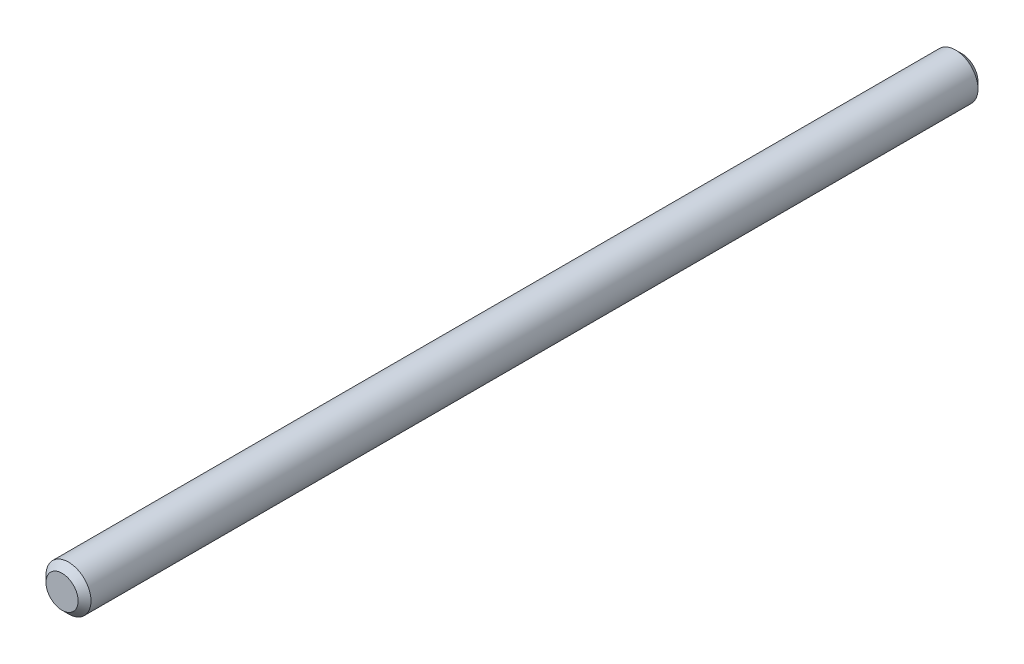
ISO-10303-21;
HEADER;
FILE_DESCRIPTION(('STEP AP214'),'2;1');
FILE_NAME('part.step','',(''),(''),'','','');
FILE_SCHEMA(('AUTOMOTIVE_DESIGN { 1 0 10303 214 1 1 1 1 }'));
ENDSEC;
DATA;
#1=APPLICATION_CONTEXT('core data for automotive mechanical design processes');
#2=APPLICATION_PROTOCOL_DEFINITION('international standard','automotive_design',2000,#1);
#3=PRODUCT_CONTEXT('',#1,'mechanical');
#4=PRODUCT('Part','Part','',(#3));
#5=PRODUCT_RELATED_PRODUCT_CATEGORY('part','',(#4));
#6=PRODUCT_DEFINITION_FORMATION('','',#4);
#7=PRODUCT_DEFINITION_CONTEXT('part definition',#1,'design');
#8=PRODUCT_DEFINITION('design','',#6,#7);
#9=PRODUCT_DEFINITION_SHAPE('','',#8);
#10=(LENGTH_UNIT() NAMED_UNIT(*) SI_UNIT(.MILLI.,.METRE.));
#11=(NAMED_UNIT(*) PLANE_ANGLE_UNIT() SI_UNIT($,.RADIAN.));
#12=(NAMED_UNIT(*) SI_UNIT($,.STERADIAN.) SOLID_ANGLE_UNIT());
#13=UNCERTAINTY_MEASURE_WITH_UNIT(LENGTH_MEASURE(1.E-05),#10,'distance_accuracy_value','');
#14=(GEOMETRIC_REPRESENTATION_CONTEXT(3) GLOBAL_UNCERTAINTY_ASSIGNED_CONTEXT((#13)) GLOBAL_UNIT_ASSIGNED_CONTEXT((#10,
#11,#12)) REPRESENTATION_CONTEXT('',''));
#15=CARTESIAN_POINT('',(0.,0.,0.));
#16=DIRECTION('',(0.,0.,1.));
#17=DIRECTION('',(1.,0.,0.));
#18=AXIS2_PLACEMENT_3D('',#15,#16,#17);
#19=CARTESIAN_POINT('',(0.,0.,70.));
#20=DIRECTION('',(0.,0.,-1.));
#21=DIRECTION('',(-1.,0.,0.));
#22=AXIS2_PLACEMENT_3D('',#19,#20,#21);
#23=CYLINDRICAL_SURFACE('',#22,1.75);
#24=CARTESIAN_POINT('',(0.,0.,69.5));
#25=DIRECTION('',(0.,0.,1.));
#26=DIRECTION('',(1.,0.,0.));
#27=AXIS2_PLACEMENT_3D('',#24,#25,#26);
#28=CIRCLE('',#27,1.75);
#29=CARTESIAN_POINT('',(1.75,0.,69.5));
#30=VERTEX_POINT('',#29);
#31=EDGE_CURVE('E51',#30,#30,#28,.F.);
#32=ORIENTED_EDGE('',*,*,#31,.T.);
#33=EDGE_LOOP('',(#32));
#34=FACE_BOUND('',#33,.T.);
#35=CARTESIAN_POINT('',(0.,0.,0.499999999999987));
#36=DIRECTION('',(0.,0.,1.));
#37=DIRECTION('',(1.,0.,0.));
#38=AXIS2_PLACEMENT_3D('',#35,#36,#37);
#39=CIRCLE('',#38,1.75);
#40=CARTESIAN_POINT('',(1.75,0.,0.499999999999987));
#41=VERTEX_POINT('',#40);
#42=EDGE_CURVE('E57',#41,#41,#39,.T.);
#43=ORIENTED_EDGE('',*,*,#42,.T.);
#44=EDGE_LOOP('',(#43));
#45=FACE_BOUND('',#44,.T.);
#46=ADVANCED_FACE('F42',(#34,#45),#23,.T.);
#47=CARTESIAN_POINT('',(0.,0.,70.));
#48=DIRECTION('',(0.,0.,1.));
#49=DIRECTION('',(1.,0.,0.));
#50=AXIS2_PLACEMENT_3D('',#47,#48,#49);
#51=PLANE('',#50);
#52=CARTESIAN_POINT('',(0.,0.,70.));
#53=DIRECTION('',(0.,0.,1.));
#54=DIRECTION('',(1.,0.,0.));
#55=AXIS2_PLACEMENT_3D('',#52,#53,#54);
#56=CIRCLE('',#55,1.24999999999999);
#57=CARTESIAN_POINT('',(1.24999999999999,0.,70.));
#58=VERTEX_POINT('',#57);
#59=EDGE_CURVE('E63',#58,#58,#56,.T.);
#60=ORIENTED_EDGE('',*,*,#59,.T.);
#61=EDGE_LOOP('',(#60));
#62=FACE_BOUND('',#61,.T.);
#63=ADVANCED_FACE('F71',(#62),#51,.T.);
#64=CARTESIAN_POINT('',(0.,0.,0.));
#65=DIRECTION('',(0.,0.,1.));
#66=DIRECTION('',(1.,0.,0.));
#67=AXIS2_PLACEMENT_3D('',#64,#65,#66);
#68=PLANE('',#67);
#69=CARTESIAN_POINT('',(0.,0.,0.));
#70=DIRECTION('',(0.,0.,1.));
#71=DIRECTION('',(1.,0.,0.));
#72=AXIS2_PLACEMENT_3D('',#69,#70,#71);
#73=CIRCLE('',#72,1.25000000000001);
#74=CARTESIAN_POINT('',(1.25000000000001,0.,0.));
#75=VERTEX_POINT('',#74);
#76=EDGE_CURVE('E10',#75,#75,#73,.F.);
#77=ORIENTED_EDGE('',*,*,#76,.T.);
#78=EDGE_LOOP('',(#77));
#79=FACE_BOUND('',#78,.T.);
#80=ADVANCED_FACE('F75',(#79),#68,.F.);
#81=CARTESIAN_POINT('',(0.,0.,70.));
#82=DIRECTION('',(0.,0.,-1.));
#83=DIRECTION('',(-1.,0.,0.));
#84=AXIS2_PLACEMENT_3D('',#81,#82,#83);
#85=CONICAL_SURFACE('',#84,1.24999999999999,0.785398163397454);
#86=ORIENTED_EDGE('',*,*,#31,.F.);
#87=EDGE_LOOP('',(#86));
#88=FACE_BOUND('',#87,.T.);
#89=ORIENTED_EDGE('',*,*,#59,.F.);
#90=EDGE_LOOP('',(#89));
#91=FACE_BOUND('',#90,.T.);
#92=ADVANCED_FACE('F73',(#88,#91),#85,.T.);
#93=CARTESIAN_POINT('',(0.,0.,0.499999999999987));
#94=DIRECTION('',(0.,0.,1.));
#95=DIRECTION('',(1.,0.,0.));
#96=AXIS2_PLACEMENT_3D('',#93,#94,#95);
#97=CONICAL_SURFACE('',#96,1.75,0.785398163397454);
#98=ORIENTED_EDGE('',*,*,#76,.F.);
#99=EDGE_LOOP('',(#98));
#100=FACE_BOUND('',#99,.T.);
#101=ORIENTED_EDGE('',*,*,#42,.F.);
#102=EDGE_LOOP('',(#101));
#103=FACE_BOUND('',#102,.T.);
#104=ADVANCED_FACE('F45',(#100,#103),#97,.T.);
#105=CLOSED_SHELL('',(#46,#63,#80,#92,#104));
#106=MANIFOLD_SOLID_BREP('B2',#105);
#107=ADVANCED_BREP_SHAPE_REPRESENTATION('',(#18,#106),#14);
#108=SHAPE_DEFINITION_REPRESENTATION(#9,#107);
ENDSEC;
END-ISO-10303-21;
